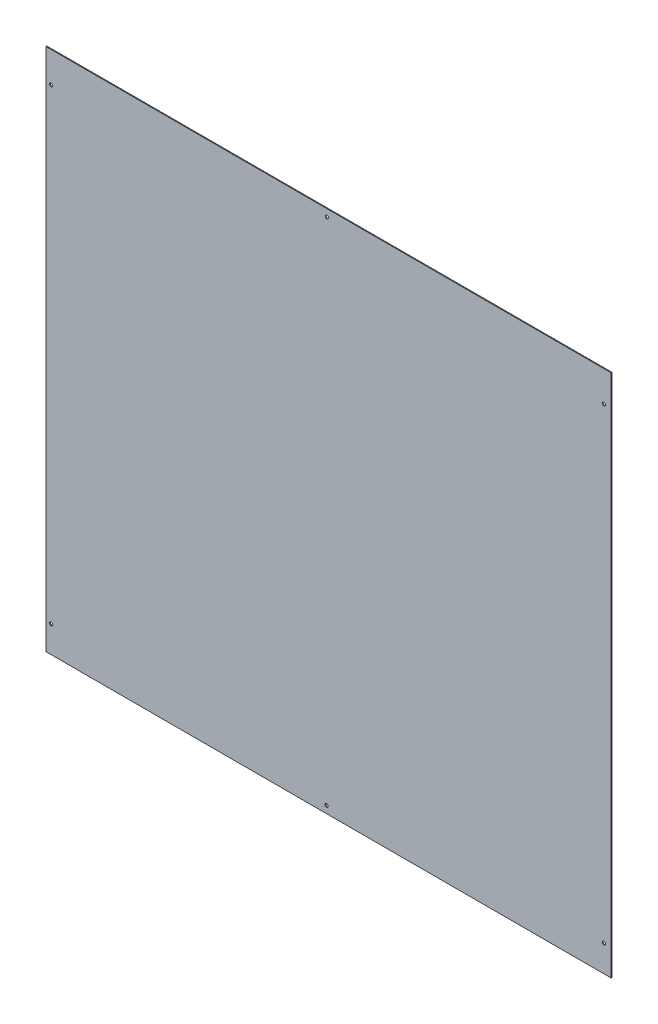
ISO-10303-21;
HEADER;
FILE_DESCRIPTION(('STEP AP214'),'2;1');
FILE_NAME('part.step','',(''),(''),'','','');
FILE_SCHEMA(('AUTOMOTIVE_DESIGN { 1 0 10303 214 1 1 1 1 }'));
ENDSEC;
DATA;
#1=APPLICATION_CONTEXT('core data for automotive mechanical design processes');
#2=APPLICATION_PROTOCOL_DEFINITION('international standard','automotive_design',2000,#1);
#3=PRODUCT_CONTEXT('',#1,'mechanical');
#4=PRODUCT('Part','Part','',(#3));
#5=PRODUCT_RELATED_PRODUCT_CATEGORY('part','',(#4));
#6=PRODUCT_DEFINITION_FORMATION('','',#4);
#7=PRODUCT_DEFINITION_CONTEXT('part definition',#1,'design');
#8=PRODUCT_DEFINITION('design','',#6,#7);
#9=PRODUCT_DEFINITION_SHAPE('','',#8);
#10=(LENGTH_UNIT() NAMED_UNIT(*) SI_UNIT(.MILLI.,.METRE.));
#11=(NAMED_UNIT(*) PLANE_ANGLE_UNIT() SI_UNIT($,.RADIAN.));
#12=(NAMED_UNIT(*) SI_UNIT($,.STERADIAN.) SOLID_ANGLE_UNIT());
#13=UNCERTAINTY_MEASURE_WITH_UNIT(LENGTH_MEASURE(1.E-05),#10,'distance_accuracy_value','');
#14=(GEOMETRIC_REPRESENTATION_CONTEXT(3) GLOBAL_UNCERTAINTY_ASSIGNED_CONTEXT((#13)) GLOBAL_UNIT_ASSIGNED_CONTEXT((#10,
#11,#12)) REPRESENTATION_CONTEXT('',''));
#15=CARTESIAN_POINT('',(0.,0.,0.));
#16=DIRECTION('',(0.,0.,1.));
#17=DIRECTION('',(1.,0.,0.));
#18=AXIS2_PLACEMENT_3D('',#15,#16,#17);
#19=CARTESIAN_POINT('',(1380.,0.,-2.));
#20=DIRECTION('',(1.,0.,0.));
#21=DIRECTION('',(0.,1.,0.));
#22=AXIS2_PLACEMENT_3D('',#19,#20,#21);
#23=PLANE('',#22);
#24=DIRECTION('',(0.,1.,0.));
#25=VECTOR('',#24,1.);
#26=CARTESIAN_POINT('',(1380.,0.,0.));
#27=LINE('',#26,#25);
#28=CARTESIAN_POINT('',(1380.,0.,0.));
#29=VERTEX_POINT('',#28);
#30=CARTESIAN_POINT('',(1380.,1280.,0.));
#31=VERTEX_POINT('',#30);
#32=EDGE_CURVE('E97',#29,#31,#27,.T.);
#33=ORIENTED_EDGE('',*,*,#32,.F.);
#34=DIRECTION('',(0.,0.,1.));
#35=VECTOR('',#34,1.);
#36=CARTESIAN_POINT('',(1380.,0.,-2.));
#37=LINE('',#36,#35);
#38=CARTESIAN_POINT('',(1380.,0.,-2.));
#39=VERTEX_POINT('',#38);
#40=EDGE_CURVE('E11',#39,#29,#37,.T.);
#41=ORIENTED_EDGE('',*,*,#40,.F.);
#42=DIRECTION('',(0.,1.,0.));
#43=VECTOR('',#42,1.);
#44=CARTESIAN_POINT('',(1380.,0.,-2.));
#45=LINE('',#44,#43);
#46=CARTESIAN_POINT('',(1380.,1280.,-2.));
#47=VERTEX_POINT('',#46);
#48=EDGE_CURVE('E90',#39,#47,#45,.T.);
#49=ORIENTED_EDGE('',*,*,#48,.T.);
#50=DIRECTION('',(0.,0.,1.));
#51=VECTOR('',#50,1.);
#52=CARTESIAN_POINT('',(1380.,1280.,-2.));
#53=LINE('',#52,#51);
#54=EDGE_CURVE('E35',#47,#31,#53,.T.);
#55=ORIENTED_EDGE('',*,*,#54,.T.);
#56=EDGE_LOOP('',(#33,#41,#49,#55));
#57=FACE_BOUND('',#56,.T.);
#58=ADVANCED_FACE('F32',(#57),#23,.T.);
#59=CARTESIAN_POINT('',(0.,0.,-2.));
#60=DIRECTION('',(0.,-1.,0.));
#61=DIRECTION('',(0.,0.,-1.));
#62=AXIS2_PLACEMENT_3D('',#59,#60,#61);
#63=PLANE('',#62);
#64=DIRECTION('',(1.,0.,0.));
#65=VECTOR('',#64,1.);
#66=CARTESIAN_POINT('',(0.,0.,0.));
#67=LINE('',#66,#65);
#68=CARTESIAN_POINT('',(0.,0.,0.));
#69=VERTEX_POINT('',#68);
#70=EDGE_CURVE('E92',#69,#29,#67,.T.);
#71=ORIENTED_EDGE('',*,*,#70,.F.);
#72=DIRECTION('',(0.,0.,1.));
#73=VECTOR('',#72,1.);
#74=CARTESIAN_POINT('',(0.,0.,-2.));
#75=LINE('',#74,#73);
#76=CARTESIAN_POINT('',(0.,0.,-2.));
#77=VERTEX_POINT('',#76);
#78=EDGE_CURVE('E41',#77,#69,#75,.T.);
#79=ORIENTED_EDGE('',*,*,#78,.F.);
#80=DIRECTION('',(1.,0.,0.));
#81=VECTOR('',#80,1.);
#82=CARTESIAN_POINT('',(0.,0.,-2.));
#83=LINE('',#82,#81);
#84=EDGE_CURVE('E87',#77,#39,#83,.T.);
#85=ORIENTED_EDGE('',*,*,#84,.T.);
#86=ORIENTED_EDGE('',*,*,#40,.T.);
#87=EDGE_LOOP('',(#71,#79,#85,#86));
#88=FACE_BOUND('',#87,.T.);
#89=ADVANCED_FACE('F108',(#88),#63,.T.);
#90=CARTESIAN_POINT('',(0.,1280.,-2.));
#91=DIRECTION('',(-1.,0.,0.));
#92=DIRECTION('',(0.,-1.,0.));
#93=AXIS2_PLACEMENT_3D('',#90,#91,#92);
#94=PLANE('',#93);
#95=DIRECTION('',(0.,-1.,0.));
#96=VECTOR('',#95,1.);
#97=CARTESIAN_POINT('',(0.,1280.,0.));
#98=LINE('',#97,#96);
#99=CARTESIAN_POINT('',(0.,1280.,0.));
#100=VERTEX_POINT('',#99);
#101=EDGE_CURVE('E82',#100,#69,#98,.T.);
#102=ORIENTED_EDGE('',*,*,#101,.F.);
#103=DIRECTION('',(0.,0.,1.));
#104=VECTOR('',#103,1.);
#105=CARTESIAN_POINT('',(0.,1280.,-2.));
#106=LINE('',#105,#104);
#107=CARTESIAN_POINT('',(0.,1280.,-2.));
#108=VERTEX_POINT('',#107);
#109=EDGE_CURVE('E77',#108,#100,#106,.T.);
#110=ORIENTED_EDGE('',*,*,#109,.F.);
#111=DIRECTION('',(0.,-1.,0.));
#112=VECTOR('',#111,1.);
#113=CARTESIAN_POINT('',(0.,1280.,-2.));
#114=LINE('',#113,#112);
#115=EDGE_CURVE('E80',#108,#77,#114,.T.);
#116=ORIENTED_EDGE('',*,*,#115,.T.);
#117=ORIENTED_EDGE('',*,*,#78,.T.);
#118=EDGE_LOOP('',(#102,#110,#116,#117));
#119=FACE_BOUND('',#118,.T.);
#120=ADVANCED_FACE('F79',(#119),#94,.T.);
#121=CARTESIAN_POINT('',(1380.,1280.,-2.));
#122=DIRECTION('',(0.,1.,0.));
#123=DIRECTION('',(0.,0.,1.));
#124=AXIS2_PLACEMENT_3D('',#121,#122,#123);
#125=PLANE('',#124);
#126=DIRECTION('',(-1.,0.,0.));
#127=VECTOR('',#126,1.);
#128=CARTESIAN_POINT('',(1380.,1280.,0.));
#129=LINE('',#128,#127);
#130=EDGE_CURVE('E100',#31,#100,#129,.T.);
#131=ORIENTED_EDGE('',*,*,#130,.F.);
#132=ORIENTED_EDGE('',*,*,#54,.F.);
#133=DIRECTION('',(-1.,0.,0.));
#134=VECTOR('',#133,1.);
#135=CARTESIAN_POINT('',(1380.,1280.,-2.));
#136=LINE('',#135,#134);
#137=EDGE_CURVE('E86',#47,#108,#136,.T.);
#138=ORIENTED_EDGE('',*,*,#137,.T.);
#139=ORIENTED_EDGE('',*,*,#109,.T.);
#140=EDGE_LOOP('',(#131,#132,#138,#139));
#141=FACE_BOUND('',#140,.T.);
#142=ADVANCED_FACE('F89',(#141),#125,.T.);
#143=CARTESIAN_POINT('',(1380.,1280.,-2.));
#144=DIRECTION('',(0.,0.,1.));
#145=DIRECTION('',(1.,0.,0.));
#146=AXIS2_PLACEMENT_3D('',#143,#144,#145);
#147=PLANE('',#146);
#148=CARTESIAN_POINT('',(685.818427433017,1262.5,-2.));
#149=DIRECTION('',(0.,0.,-1.));
#150=DIRECTION('',(-1.,0.,0.));
#151=AXIS2_PLACEMENT_3D('',#148,#149,#150);
#152=CIRCLE('',#151,3.99999999999999);
#153=CARTESIAN_POINT('',(681.818427433017,1262.5,-2.));
#154=VERTEX_POINT('',#153);
#155=EDGE_CURVE('E160',#154,#154,#152,.T.);
#156=ORIENTED_EDGE('',*,*,#155,.F.);
#157=EDGE_LOOP('',(#156));
#158=FACE_BOUND('',#157,.T.);
#159=CARTESIAN_POINT('',(685.11906469908,17.5,-2.));
#160=DIRECTION('',(0.,0.,-1.));
#161=DIRECTION('',(-1.,0.,0.));
#162=AXIS2_PLACEMENT_3D('',#159,#160,#161);
#163=CIRCLE('',#162,3.99999999999999);
#164=CARTESIAN_POINT('',(681.11906469908,17.5,-2.));
#165=VERTEX_POINT('',#164);
#166=EDGE_CURVE('E164',#165,#165,#163,.T.);
#167=ORIENTED_EDGE('',*,*,#166,.F.);
#168=EDGE_LOOP('',(#167));
#169=FACE_BOUND('',#168,.T.);
#170=CARTESIAN_POINT('',(1362.5,1205.,-2.));
#171=DIRECTION('',(0.,0.,-1.));
#172=DIRECTION('',(-1.,0.,0.));
#173=AXIS2_PLACEMENT_3D('',#170,#171,#172);
#174=CIRCLE('',#173,3.99999999999999);
#175=CARTESIAN_POINT('',(1358.5,1205.,-2.));
#176=VERTEX_POINT('',#175);
#177=EDGE_CURVE('E171',#176,#176,#174,.T.);
#178=ORIENTED_EDGE('',*,*,#177,.F.);
#179=EDGE_LOOP('',(#178));
#180=FACE_BOUND('',#179,.T.);
#181=CARTESIAN_POINT('',(1362.5,65.,-2.));
#182=DIRECTION('',(0.,0.,-1.));
#183=DIRECTION('',(-1.,0.,0.));
#184=AXIS2_PLACEMENT_3D('',#181,#182,#183);
#185=CIRCLE('',#184,3.99999999999999);
#186=CARTESIAN_POINT('',(1358.5,65.,-2.));
#187=VERTEX_POINT('',#186);
#188=EDGE_CURVE('E177',#187,#187,#185,.T.);
#189=ORIENTED_EDGE('',*,*,#188,.F.);
#190=EDGE_LOOP('',(#189));
#191=FACE_BOUND('',#190,.T.);
#192=CARTESIAN_POINT('',(12.5,65.,-2.));
#193=DIRECTION('',(0.,0.,-1.));
#194=DIRECTION('',(-1.,0.,0.));
#195=AXIS2_PLACEMENT_3D('',#192,#193,#194);
#196=CIRCLE('',#195,4.);
#197=CARTESIAN_POINT('',(8.5,65.,-2.));
#198=VERTEX_POINT('',#197);
#199=EDGE_CURVE('E183',#198,#198,#196,.T.);
#200=ORIENTED_EDGE('',*,*,#199,.F.);
#201=EDGE_LOOP('',(#200));
#202=FACE_BOUND('',#201,.T.);
#203=CARTESIAN_POINT('',(12.5,1205.,-2.));
#204=DIRECTION('',(0.,0.,-1.));
#205=DIRECTION('',(-1.,0.,0.));
#206=AXIS2_PLACEMENT_3D('',#203,#204,#205);
#207=CIRCLE('',#206,4.);
#208=CARTESIAN_POINT('',(8.5,1205.,-2.));
#209=VERTEX_POINT('',#208);
#210=EDGE_CURVE('E101',#209,#209,#207,.T.);
#211=ORIENTED_EDGE('',*,*,#210,.F.);
#212=EDGE_LOOP('',(#211));
#213=FACE_BOUND('',#212,.T.);
#214=ORIENTED_EDGE('',*,*,#48,.F.);
#215=ORIENTED_EDGE('',*,*,#84,.F.);
#216=ORIENTED_EDGE('',*,*,#115,.F.);
#217=ORIENTED_EDGE('',*,*,#137,.F.);
#218=EDGE_LOOP('',(#214,#215,#216,#217));
#219=FACE_BOUND('',#218,.T.);
#220=ADVANCED_FACE('F85',(#158,#169,#180,#191,#202,#213,#219),#147,.F.);
#221=CARTESIAN_POINT('',(1380.,1280.,0.));
#222=DIRECTION('',(0.,0.,1.));
#223=DIRECTION('',(1.,0.,0.));
#224=AXIS2_PLACEMENT_3D('',#221,#222,#223);
#225=PLANE('',#224);
#226=CARTESIAN_POINT('',(685.818427433017,1262.5,0.));
#227=DIRECTION('',(0.,0.,1.));
#228=DIRECTION('',(1.,0.,0.));
#229=AXIS2_PLACEMENT_3D('',#226,#227,#228);
#230=CIRCLE('',#229,3.99999999999999);
#231=CARTESIAN_POINT('',(689.818427433017,1262.5,0.));
#232=VERTEX_POINT('',#231);
#233=EDGE_CURVE('E158',#232,#232,#230,.F.);
#234=ORIENTED_EDGE('',*,*,#233,.T.);
#235=EDGE_LOOP('',(#234));
#236=FACE_BOUND('',#235,.T.);
#237=CARTESIAN_POINT('',(685.11906469908,17.5,0.));
#238=DIRECTION('',(0.,0.,1.));
#239=DIRECTION('',(1.,0.,0.));
#240=AXIS2_PLACEMENT_3D('',#237,#238,#239);
#241=CIRCLE('',#240,3.99999999999999);
#242=CARTESIAN_POINT('',(689.11906469908,17.5,0.));
#243=VERTEX_POINT('',#242);
#244=EDGE_CURVE('E161',#243,#243,#241,.F.);
#245=ORIENTED_EDGE('',*,*,#244,.T.);
#246=EDGE_LOOP('',(#245));
#247=FACE_BOUND('',#246,.T.);
#248=CARTESIAN_POINT('',(1362.5,1205.,0.));
#249=DIRECTION('',(0.,0.,1.));
#250=DIRECTION('',(1.,0.,0.));
#251=AXIS2_PLACEMENT_3D('',#248,#249,#250);
#252=CIRCLE('',#251,3.99999999999999);
#253=CARTESIAN_POINT('',(1366.5,1205.,0.));
#254=VERTEX_POINT('',#253);
#255=EDGE_CURVE('E169',#254,#254,#252,.F.);
#256=ORIENTED_EDGE('',*,*,#255,.T.);
#257=EDGE_LOOP('',(#256));
#258=FACE_BOUND('',#257,.T.);
#259=CARTESIAN_POINT('',(1362.5,65.,0.));
#260=DIRECTION('',(0.,0.,1.));
#261=DIRECTION('',(1.,0.,0.));
#262=AXIS2_PLACEMENT_3D('',#259,#260,#261);
#263=CIRCLE('',#262,3.99999999999999);
#264=CARTESIAN_POINT('',(1366.5,65.,0.));
#265=VERTEX_POINT('',#264);
#266=EDGE_CURVE('E174',#265,#265,#263,.F.);
#267=ORIENTED_EDGE('',*,*,#266,.T.);
#268=EDGE_LOOP('',(#267));
#269=FACE_BOUND('',#268,.T.);
#270=CARTESIAN_POINT('',(12.5,65.,0.));
#271=DIRECTION('',(0.,0.,1.));
#272=DIRECTION('',(1.,0.,0.));
#273=AXIS2_PLACEMENT_3D('',#270,#271,#272);
#274=CIRCLE('',#273,4.);
#275=CARTESIAN_POINT('',(16.5,65.,0.));
#276=VERTEX_POINT('',#275);
#277=EDGE_CURVE('E180',#276,#276,#274,.F.);
#278=ORIENTED_EDGE('',*,*,#277,.T.);
#279=EDGE_LOOP('',(#278));
#280=FACE_BOUND('',#279,.T.);
#281=CARTESIAN_POINT('',(12.5,1205.,0.));
#282=DIRECTION('',(0.,0.,1.));
#283=DIRECTION('',(1.,0.,0.));
#284=AXIS2_PLACEMENT_3D('',#281,#282,#283);
#285=CIRCLE('',#284,4.);
#286=CARTESIAN_POINT('',(16.5,1205.,0.));
#287=VERTEX_POINT('',#286);
#288=EDGE_CURVE('E186',#287,#287,#285,.F.);
#289=ORIENTED_EDGE('',*,*,#288,.T.);
#290=EDGE_LOOP('',(#289));
#291=FACE_BOUND('',#290,.T.);
#292=ORIENTED_EDGE('',*,*,#32,.T.);
#293=ORIENTED_EDGE('',*,*,#130,.T.);
#294=ORIENTED_EDGE('',*,*,#101,.T.);
#295=ORIENTED_EDGE('',*,*,#70,.T.);
#296=EDGE_LOOP('',(#292,#293,#294,#295));
#297=FACE_BOUND('',#296,.T.);
#298=ADVANCED_FACE('F107',(#236,#247,#258,#269,#280,#291,#297),#225,.T.);
#299=CARTESIAN_POINT('',(12.5,1205.,0.00100000000000013));
#300=DIRECTION('',(0.,0.,-1.));
#301=DIRECTION('',(-1.,0.,0.));
#302=AXIS2_PLACEMENT_3D('',#299,#300,#301);
#303=CYLINDRICAL_SURFACE('',#302,4.);
#304=ORIENTED_EDGE('',*,*,#288,.F.);
#305=EDGE_LOOP('',(#304));
#306=FACE_BOUND('',#305,.T.);
#307=ORIENTED_EDGE('',*,*,#210,.T.);
#308=EDGE_LOOP('',(#307));
#309=FACE_BOUND('',#308,.T.);
#310=ADVANCED_FACE('F126',(#306,#309),#303,.F.);
#311=CARTESIAN_POINT('',(12.5,65.,0.00100000000000013));
#312=DIRECTION('',(0.,0.,-1.));
#313=DIRECTION('',(-1.,0.,0.));
#314=AXIS2_PLACEMENT_3D('',#311,#312,#313);
#315=CYLINDRICAL_SURFACE('',#314,4.);
#316=ORIENTED_EDGE('',*,*,#277,.F.);
#317=EDGE_LOOP('',(#316));
#318=FACE_BOUND('',#317,.T.);
#319=ORIENTED_EDGE('',*,*,#199,.T.);
#320=EDGE_LOOP('',(#319));
#321=FACE_BOUND('',#320,.T.);
#322=ADVANCED_FACE('F133',(#318,#321),#315,.F.);
#323=CARTESIAN_POINT('',(1362.5,65.,0.00100000000000013));
#324=DIRECTION('',(0.,0.,-1.));
#325=DIRECTION('',(-1.,0.,0.));
#326=AXIS2_PLACEMENT_3D('',#323,#324,#325);
#327=CYLINDRICAL_SURFACE('',#326,3.99999999999999);
#328=ORIENTED_EDGE('',*,*,#266,.F.);
#329=EDGE_LOOP('',(#328));
#330=FACE_BOUND('',#329,.T.);
#331=ORIENTED_EDGE('',*,*,#188,.T.);
#332=EDGE_LOOP('',(#331));
#333=FACE_BOUND('',#332,.T.);
#334=ADVANCED_FACE('F137',(#330,#333),#327,.F.);
#335=CARTESIAN_POINT('',(1362.5,1205.,0.00100000000000013));
#336=DIRECTION('',(0.,0.,-1.));
#337=DIRECTION('',(-1.,0.,0.));
#338=AXIS2_PLACEMENT_3D('',#335,#336,#337);
#339=CYLINDRICAL_SURFACE('',#338,3.99999999999999);
#340=ORIENTED_EDGE('',*,*,#255,.F.);
#341=EDGE_LOOP('',(#340));
#342=FACE_BOUND('',#341,.T.);
#343=ORIENTED_EDGE('',*,*,#177,.T.);
#344=EDGE_LOOP('',(#343));
#345=FACE_BOUND('',#344,.T.);
#346=ADVANCED_FACE('F141',(#342,#345),#339,.F.);
#347=CARTESIAN_POINT('',(685.11906469908,17.5,0.00100000000000013));
#348=DIRECTION('',(0.,0.,-1.));
#349=DIRECTION('',(-1.,0.,0.));
#350=AXIS2_PLACEMENT_3D('',#347,#348,#349);
#351=CYLINDRICAL_SURFACE('',#350,3.99999999999999);
#352=ORIENTED_EDGE('',*,*,#244,.F.);
#353=EDGE_LOOP('',(#352));
#354=FACE_BOUND('',#353,.T.);
#355=ORIENTED_EDGE('',*,*,#166,.T.);
#356=EDGE_LOOP('',(#355));
#357=FACE_BOUND('',#356,.T.);
#358=ADVANCED_FACE('F145',(#354,#357),#351,.F.);
#359=CARTESIAN_POINT('',(685.818427433017,1262.5,0.00100000000000013));
#360=DIRECTION('',(0.,0.,-1.));
#361=DIRECTION('',(-1.,0.,0.));
#362=AXIS2_PLACEMENT_3D('',#359,#360,#361);
#363=CYLINDRICAL_SURFACE('',#362,3.99999999999999);
#364=ORIENTED_EDGE('',*,*,#233,.F.);
#365=EDGE_LOOP('',(#364));
#366=FACE_BOUND('',#365,.T.);
#367=ORIENTED_EDGE('',*,*,#155,.T.);
#368=EDGE_LOOP('',(#367));
#369=FACE_BOUND('',#368,.T.);
#370=ADVANCED_FACE('F149',(#366,#369),#363,.F.);
#371=CLOSED_SHELL('',(#58,#89,#120,#142,#220,#298,#310,#322,#334,#346,#358,#370));
#372=MANIFOLD_SOLID_BREP('B2',#371);
#373=ADVANCED_BREP_SHAPE_REPRESENTATION('',(#18,#372),#14);
#374=SHAPE_DEFINITION_REPRESENTATION(#9,#373);
ENDSEC;
END-ISO-10303-21;
